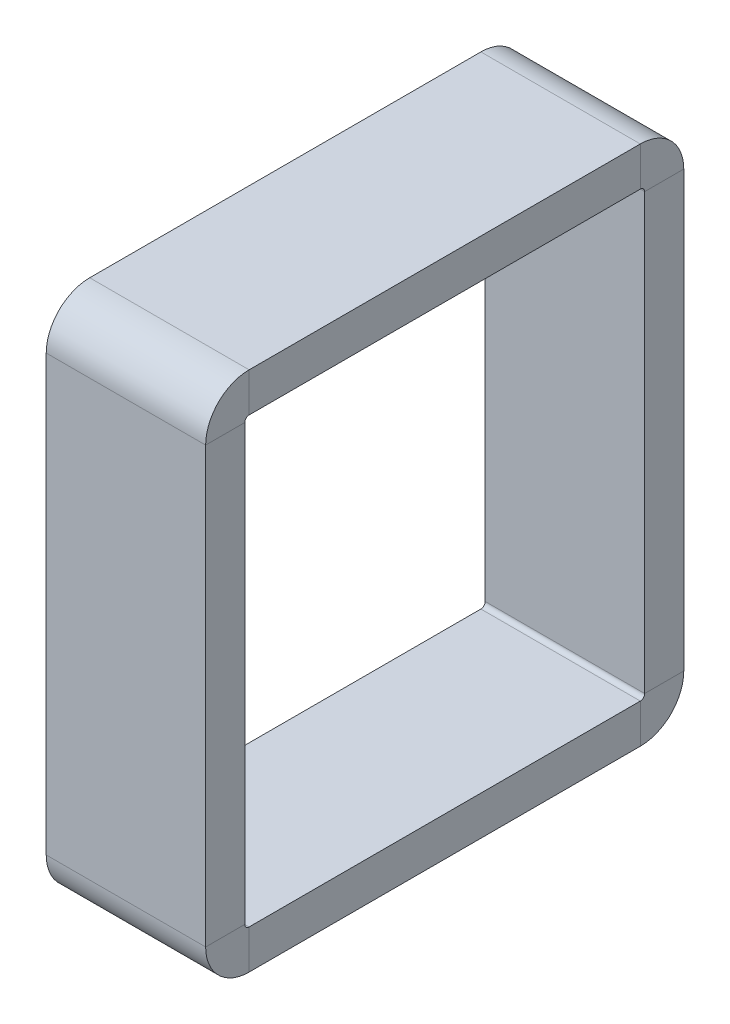
ISO-10303-21;
HEADER;
FILE_DESCRIPTION(('STEP AP214'),'2;1');
FILE_NAME('part.step','',(''),(''),'','','');
FILE_SCHEMA(('AUTOMOTIVE_DESIGN { 1 0 10303 214 1 1 1 1 }'));
ENDSEC;
DATA;
#1=APPLICATION_CONTEXT('core data for automotive mechanical design processes');
#2=APPLICATION_PROTOCOL_DEFINITION('international standard','automotive_design',2000,#1);
#3=PRODUCT_CONTEXT('',#1,'mechanical');
#4=PRODUCT('Part','Part','',(#3));
#5=PRODUCT_RELATED_PRODUCT_CATEGORY('part','',(#4));
#6=PRODUCT_DEFINITION_FORMATION('','',#4);
#7=PRODUCT_DEFINITION_CONTEXT('part definition',#1,'design');
#8=PRODUCT_DEFINITION('design','',#6,#7);
#9=PRODUCT_DEFINITION_SHAPE('','',#8);
#10=(LENGTH_UNIT() NAMED_UNIT(*) SI_UNIT(.MILLI.,.METRE.));
#11=(NAMED_UNIT(*) PLANE_ANGLE_UNIT() SI_UNIT($,.RADIAN.));
#12=(NAMED_UNIT(*) SI_UNIT($,.STERADIAN.) SOLID_ANGLE_UNIT());
#13=UNCERTAINTY_MEASURE_WITH_UNIT(LENGTH_MEASURE(1.E-05),#10,'distance_accuracy_value','');
#14=(GEOMETRIC_REPRESENTATION_CONTEXT(3) GLOBAL_UNCERTAINTY_ASSIGNED_CONTEXT((#13)) GLOBAL_UNIT_ASSIGNED_CONTEXT((#10,
#11,#12)) REPRESENTATION_CONTEXT('',''));
#15=CARTESIAN_POINT('',(0.,0.,0.));
#16=DIRECTION('',(0.,0.,1.));
#17=DIRECTION('',(1.,0.,0.));
#18=AXIS2_PLACEMENT_3D('',#15,#16,#17);
#19=CARTESIAN_POINT('',(3.716777825355,0.754999781003945,-3.2461214549909));
#20=DIRECTION('',(-1.,0.,0.));
#21=DIRECTION('',(0.,8.74227765734758E-08,-1.));
#22=AXIS2_PLACEMENT_3D('',#19,#20,#21);
#23=PLANE('',#22);
#24=CARTESIAN_POINT('',(3.716777825355,0.749999781441055,-3.25112145542801));
#25=DIRECTION('',(1.,0.,0.));
#26=DIRECTION('',(0.,-0.999999999999996,-8.74265104755868E-08));
#27=AXIS2_PLACEMENT_3D('',#24,#25,#26);
#28=CIRCLE('',#27,0.00999999999999601);
#29=CARTESIAN_POINT('',(3.716777825355,0.739999781441059,-3.25112145630224));
#30=VERTEX_POINT('',#29);
#31=CARTESIAN_POINT('',(3.716777825355,0.749999782316286,-3.26112145542801));
#32=VERTEX_POINT('',#31);
#33=EDGE_CURVE('E11',#30,#32,#28,.T.);
#34=ORIENTED_EDGE('',*,*,#33,.F.);
#35=DIRECTION('',(0.,0.999999999999996,8.74227702585115E-08));
#36=VECTOR('',#35,1.);
#37=CARTESIAN_POINT('',(3.716777825355,0.649999781442059,-3.25112146417129));
#38=LINE('',#37,#36);
#39=CARTESIAN_POINT('',(3.716777825355,0.649999781442059,-3.25112146417029));
#40=VERTEX_POINT('',#39);
#41=EDGE_CURVE('E295',#40,#30,#38,.T.);
#42=ORIENTED_EDGE('',*,*,#41,.F.);
#43=CARTESIAN_POINT('',(3.716777825355,0.749999781441727,-3.25112145542834));
#44=DIRECTION('',(-1.,0.,0.));
#45=DIRECTION('',(0.,8.74165517753117E-08,-0.999999999999996));
#46=AXIS2_PLACEMENT_3D('',#43,#44,#45);
#47=CIRCLE('',#46,0.0999999999996679);
#48=CARTESIAN_POINT('',(3.716777825355,0.749999790184336,-3.35112145542801));
#49=VERTEX_POINT('',#48);
#50=EDGE_CURVE('E292',#49,#40,#47,.T.);
#51=ORIENTED_EDGE('',*,*,#50,.F.);
#52=DIRECTION('',(0.,8.74227727247025E-08,-0.999999999999996));
#53=VECTOR('',#52,1.);
#54=CARTESIAN_POINT('',(3.716777825355,0.749999782315287,-3.26112145542801));
#55=LINE('',#54,#53);
#56=EDGE_CURVE('E281',#32,#49,#55,.T.);
#57=ORIENTED_EDGE('',*,*,#56,.F.);
#58=EDGE_LOOP('',(#34,#42,#51,#57));
#59=FACE_BOUND('',#58,.T.);
#60=ADVANCED_FACE('F17',(#59),#23,.F.);
#61=CARTESIAN_POINT('',(3.35,0.754999781003945,-3.2461214549909));
#62=DIRECTION('',(-1.,0.,0.));
#63=DIRECTION('',(0.,8.74227765734758E-08,-1.));
#64=AXIS2_PLACEMENT_3D('',#61,#62,#63);
#65=PLANE('',#64);
#66=DIRECTION('',(0.,8.74227764254459E-08,-0.999999999999996));
#67=VECTOR('',#66,1.);
#68=CARTESIAN_POINT('',(3.35,0.749999782315286,-3.26112145542801));
#69=LINE('',#68,#67);
#70=CARTESIAN_POINT('',(3.35,0.749999782316286,-3.26112145542801));
#71=VERTEX_POINT('',#70);
#72=CARTESIAN_POINT('',(3.35,0.749999790184336,-3.35112145542801));
#73=VERTEX_POINT('',#72);
#74=EDGE_CURVE('E24',#71,#73,#69,.T.);
#75=ORIENTED_EDGE('',*,*,#74,.T.);
#76=CARTESIAN_POINT('',(3.35,0.749999781441722,-3.25112145542835));
#77=DIRECTION('',(-1.,0.,0.));
#78=DIRECTION('',(0.,8.74161432132383E-08,-0.999999999999996));
#79=AXIS2_PLACEMENT_3D('',#76,#77,#78);
#80=CIRCLE('',#79,0.0999999999996679);
#81=CARTESIAN_POINT('',(3.35,0.649999781441059,-3.25112146417029));
#82=VERTEX_POINT('',#81);
#83=EDGE_CURVE('E290',#73,#82,#80,.T.);
#84=ORIENTED_EDGE('',*,*,#83,.T.);
#85=DIRECTION('',(0.,-0.999999999999996,-8.74227702585115E-08));
#86=VECTOR('',#85,1.);
#87=CARTESIAN_POINT('',(3.35,0.739999781441059,-3.25112145630324));
#88=LINE('',#87,#86);
#89=CARTESIAN_POINT('',(3.35,0.739999781441059,-3.25112145630224));
#90=VERTEX_POINT('',#89);
#91=EDGE_CURVE('E284',#90,#82,#88,.T.);
#92=ORIENTED_EDGE('',*,*,#91,.F.);
#93=CARTESIAN_POINT('',(3.35,0.74999978144101,-3.25112145542806));
#94=DIRECTION('',(1.,0.,0.));
#95=DIRECTION('',(0.,-0.999999999999996,-8.74178951449157E-08));
#96=AXIS2_PLACEMENT_3D('',#93,#94,#95);
#97=CIRCLE('',#96,0.00999999999999601);
#98=EDGE_CURVE('E274',#90,#71,#97,.T.);
#99=ORIENTED_EDGE('',*,*,#98,.T.);
#100=EDGE_LOOP('',(#75,#84,#92,#99));
#101=FACE_BOUND('',#100,.T.);
#102=ADVANCED_FACE('F409',(#101),#65,.T.);
#103=CARTESIAN_POINT('',(3.716777825355,0.749999781441727,-3.25112145542834));
#104=DIRECTION('',(-1.,0.,0.));
#105=DIRECTION('',(0.,-1.,-8.74227765734759E-08));
#106=AXIS2_PLACEMENT_3D('',#103,#104,#105);
#107=CYLINDRICAL_SURFACE('',#106,0.0999999999996679);
#108=ORIENTED_EDGE('',*,*,#50,.T.);
#109=DIRECTION('',(1.,0.,0.));
#110=VECTOR('',#109,1.);
#111=CARTESIAN_POINT('',(3.35,0.649999781442059,-3.25112146417129));
#112=LINE('',#111,#110);
#113=EDGE_CURVE('E287',#82,#40,#112,.T.);
#114=ORIENTED_EDGE('',*,*,#113,.F.);
#115=ORIENTED_EDGE('',*,*,#83,.F.);
#116=DIRECTION('',(-1.,0.,0.));
#117=VECTOR('',#116,1.);
#118=CARTESIAN_POINT('',(3.716777825355,0.749999790183336,-3.35112145542801));
#119=LINE('',#118,#117);
#120=EDGE_CURVE('E268',#49,#73,#119,.T.);
#121=ORIENTED_EDGE('',*,*,#120,.F.);
#122=EDGE_LOOP('',(#108,#114,#115,#121));
#123=FACE_BOUND('',#122,.T.);
#124=ADVANCED_FACE('F345',(#123),#107,.T.);
#125=CARTESIAN_POINT('',(3.716777825355,0.749999781441055,-3.25112145542801));
#126=DIRECTION('',(1.,1.22913533173695E-13,1.22913554664579E-13));
#127=DIRECTION('',(1.22913543919138E-13,-1.,-8.74227765734759E-08));
#128=AXIS2_PLACEMENT_3D('',#125,#126,#127);
#129=CYLINDRICAL_SURFACE('',#128,0.00999999999999601);
#130=ORIENTED_EDGE('',*,*,#33,.T.);
#131=DIRECTION('',(-1.,-1.36334428017066E-12,0.));
#132=VECTOR('',#131,1.);
#133=CARTESIAN_POINT('',(3.716777825355,0.749999782315536,-3.26112145542801));
#134=LINE('',#133,#132);
#135=EDGE_CURVE('E276',#32,#71,#134,.T.);
#136=ORIENTED_EDGE('',*,*,#135,.T.);
#137=ORIENTED_EDGE('',*,*,#98,.F.);
#138=DIRECTION('',(-1.,0.,0.));
#139=VECTOR('',#138,1.);
#140=CARTESIAN_POINT('',(3.716777825355,0.739999781441059,-3.25112145630324));
#141=LINE('',#140,#139);
#142=EDGE_CURVE('E262',#30,#90,#141,.T.);
#143=ORIENTED_EDGE('',*,*,#142,.F.);
#144=EDGE_LOOP('',(#130,#136,#137,#143));
#145=FACE_BOUND('',#144,.T.);
#146=ADVANCED_FACE('F304',(#145),#129,.F.);
#147=CARTESIAN_POINT('',(3.716777825355,0.64999970276156,-2.35112146417129));
#148=DIRECTION('',(-1.,0.,0.));
#149=DIRECTION('',(0.,1.,8.74227765734759E-08));
#150=AXIS2_PLACEMENT_3D('',#147,#148,#149);
#151=PLANE('',#150);
#152=DIRECTION('',(0.,8.7422776548804E-08,-0.999999999999996));
#153=VECTOR('',#152,1.);
#154=CARTESIAN_POINT('',(3.716777825355,0.64999970276156,-2.35112146417129));
#155=LINE('',#154,#153);
#156=CARTESIAN_POINT('',(3.716777825354,0.64999970276456,-2.35112146416829));
#157=VERTEX_POINT('',#156);
#158=EDGE_CURVE('E278',#157,#40,#155,.T.);
#159=ORIENTED_EDGE('',*,*,#158,.T.);
#160=ORIENTED_EDGE('',*,*,#41,.T.);
#161=DIRECTION('',(0.,8.74227765488039E-08,-0.999999999999996));
#162=VECTOR('',#161,1.);
#163=CARTESIAN_POINT('',(3.716777825355,0.73999970276056,-2.35112145630324));
#164=LINE('',#163,#162);
#165=CARTESIAN_POINT('',(3.716777825354,0.73999970276356,-2.35112145630024));
#166=VERTEX_POINT('',#165);
#167=EDGE_CURVE('E265',#166,#30,#164,.T.);
#168=ORIENTED_EDGE('',*,*,#167,.F.);
#169=DIRECTION('',(0.,0.999999999999996,8.74333839915547E-08));
#170=VECTOR('',#169,1.);
#171=CARTESIAN_POINT('',(3.716777825354,0.649999702762515,-2.35112146417224));
#172=LINE('',#171,#170);
#173=EDGE_CURVE('E147',#157,#166,#172,.T.);
#174=ORIENTED_EDGE('',*,*,#173,.F.);
#175=EDGE_LOOP('',(#159,#160,#168,#174));
#176=FACE_BOUND('',#175,.T.);
#177=ADVANCED_FACE('F297',(#176),#151,.F.);
#178=CARTESIAN_POINT('',(3.35,0.64999970276156,-2.35112146417129));
#179=DIRECTION('',(0.,1.,8.74227765734759E-08));
#180=DIRECTION('',(1.,0.,0.));
#181=AXIS2_PLACEMENT_3D('',#178,#179,#180);
#182=PLANE('',#181);
#183=DIRECTION('',(0.,8.7422776548804E-08,-0.999999999999996));
#184=VECTOR('',#183,1.);
#185=CARTESIAN_POINT('',(3.35,0.64999970276156,-2.35112146417129));
#186=LINE('',#185,#184);
#187=CARTESIAN_POINT('',(3.350000000001,0.64999970276456,-2.35112146416829));
#188=VERTEX_POINT('',#187);
#189=EDGE_CURVE('E271',#188,#82,#186,.T.);
#190=ORIENTED_EDGE('',*,*,#189,.T.);
#191=ORIENTED_EDGE('',*,*,#113,.T.);
#192=ORIENTED_EDGE('',*,*,#158,.F.);
#193=DIRECTION('',(1.,0.,0.));
#194=VECTOR('',#193,1.);
#195=CARTESIAN_POINT('',(3.35,0.64999970276156,-2.35112146417129));
#196=LINE('',#195,#194);
#197=EDGE_CURVE('E255',#188,#157,#196,.T.);
#198=ORIENTED_EDGE('',*,*,#197,.F.);
#199=EDGE_LOOP('',(#190,#191,#192,#198));
#200=FACE_BOUND('',#199,.T.);
#201=ADVANCED_FACE('F342',(#200),#182,.F.);
#202=CARTESIAN_POINT('',(3.716777825355,0.73999970276056,-2.35112145630324));
#203=DIRECTION('',(0.,-1.,-8.74227765734759E-08));
#204=DIRECTION('',(-1.,0.,0.));
#205=AXIS2_PLACEMENT_3D('',#202,#203,#204);
#206=PLANE('',#205);
#207=ORIENTED_EDGE('',*,*,#167,.T.);
#208=ORIENTED_EDGE('',*,*,#142,.T.);
#209=DIRECTION('',(0.,8.74227765488039E-08,-0.999999999999996));
#210=VECTOR('',#209,1.);
#211=CARTESIAN_POINT('',(3.35,0.73999970276056,-2.35112145630324));
#212=LINE('',#211,#210);
#213=CARTESIAN_POINT('',(3.350000000001,0.73999970276356,-2.35112145630024));
#214=VERTEX_POINT('',#213);
#215=EDGE_CURVE('E259',#214,#90,#212,.T.);
#216=ORIENTED_EDGE('',*,*,#215,.F.);
#217=DIRECTION('',(-1.,0.,0.));
#218=VECTOR('',#217,1.);
#219=CARTESIAN_POINT('',(3.716777825355,0.73999970276056,-2.35112145630324));
#220=LINE('',#219,#218);
#221=EDGE_CURVE('E251',#166,#214,#220,.T.);
#222=ORIENTED_EDGE('',*,*,#221,.F.);
#223=EDGE_LOOP('',(#207,#208,#216,#222));
#224=FACE_BOUND('',#223,.T.);
#225=ADVANCED_FACE('F301',(#224),#206,.F.);
#226=CARTESIAN_POINT('',(3.35,0.73999970276056,-2.35112145630324));
#227=DIRECTION('',(1.,0.,0.));
#228=DIRECTION('',(0.,-1.,-8.74227765734759E-08));
#229=AXIS2_PLACEMENT_3D('',#226,#227,#228);
#230=PLANE('',#229);
#231=ORIENTED_EDGE('',*,*,#215,.T.);
#232=ORIENTED_EDGE('',*,*,#91,.T.);
#233=ORIENTED_EDGE('',*,*,#189,.F.);
#234=DIRECTION('',(0.,-0.999999999999996,-8.74223508406647E-08));
#235=VECTOR('',#234,1.);
#236=CARTESIAN_POINT('',(3.350000000001,0.739999702760827,-2.35112145630328));
#237=LINE('',#236,#235);
#238=EDGE_CURVE('E242',#214,#188,#237,.T.);
#239=ORIENTED_EDGE('',*,*,#238,.F.);
#240=EDGE_LOOP('',(#231,#232,#233,#239));
#241=FACE_BOUND('',#240,.T.);
#242=ADVANCED_FACE('F308',(#241),#230,.F.);
#243=CARTESIAN_POINT('',(3.716777825355,1.79999979455448,-3.4011213636351));
#244=DIRECTION('',(1.,0.,0.));
#245=DIRECTION('',(0.,-8.74227765734759E-08,1.));
#246=AXIS2_PLACEMENT_3D('',#243,#244,#245);
#247=PLANE('',#246);
#248=ORIENTED_EDGE('',*,*,#56,.T.);
#249=DIRECTION('',(0.,0.999999999999996,8.74207763956744E-08));
#250=VECTOR('',#249,1.);
#251=CARTESIAN_POINT('',(3.716777825355,0.749999790183337,-3.35112145542801));
#252=LINE('',#251,#250);
#253=CARTESIAN_POINT('',(3.716777825355,1.74999979018234,-3.35112136800623));
#254=VERTEX_POINT('',#253);
#255=EDGE_CURVE('E253',#49,#254,#252,.T.);
#256=ORIENTED_EDGE('',*,*,#255,.T.);
#257=DIRECTION('',(0.,-8.74116680263222E-08,0.999999999999996));
#258=VECTOR('',#257,1.);
#259=CARTESIAN_POINT('',(3.716777825355,1.74999979018334,-3.35112136800723));
#260=LINE('',#259,#258);
#261=CARTESIAN_POINT('',(3.716777825354,1.74999978231529,-3.26112136800623));
#262=VERTEX_POINT('',#261);
#263=EDGE_CURVE('E245',#254,#262,#260,.T.);
#264=ORIENTED_EDGE('',*,*,#263,.T.);
#265=DIRECTION('',(0.,-0.999999999999996,-8.74217769285768E-08));
#266=VECTOR('',#265,1.);
#267=CARTESIAN_POINT('',(3.716777825355,1.74999978231629,-3.26112136800623));
#268=LINE('',#267,#266);
#269=EDGE_CURVE('E233',#262,#32,#268,.T.);
#270=ORIENTED_EDGE('',*,*,#269,.T.);
#271=EDGE_LOOP('',(#248,#256,#264,#270));
#272=FACE_BOUND('',#271,.T.);
#273=ADVANCED_FACE('F350',(#272),#247,.T.);
#274=CARTESIAN_POINT('',(3.716777825355,0.749999790183336,-3.35112145542801));
#275=DIRECTION('',(0.,-8.74207763956747E-08,1.));
#276=DIRECTION('',(0.,1.,8.74207763956747E-08));
#277=AXIS2_PLACEMENT_3D('',#274,#275,#276);
#278=PLANE('',#277);
#279=ORIENTED_EDGE('',*,*,#120,.T.);
#280=DIRECTION('',(0.,0.999999999999996,8.74207763956744E-08));
#281=VECTOR('',#280,1.);
#282=CARTESIAN_POINT('',(3.35,0.749999790183336,-3.35112145542801));
#283=LINE('',#282,#281);
#284=CARTESIAN_POINT('',(3.350000000001,1.74999979018234,-3.35112136800623));
#285=VERTEX_POINT('',#284);
#286=EDGE_CURVE('E247',#73,#285,#283,.T.);
#287=ORIENTED_EDGE('',*,*,#286,.T.);
#288=DIRECTION('',(-1.,0.,0.));
#289=VECTOR('',#288,1.);
#290=CARTESIAN_POINT('',(3.716777825355,1.74999979018334,-3.35112136800723));
#291=LINE('',#290,#289);
#292=EDGE_CURVE('E236',#254,#285,#291,.T.);
#293=ORIENTED_EDGE('',*,*,#292,.F.);
#294=ORIENTED_EDGE('',*,*,#255,.F.);
#295=EDGE_LOOP('',(#279,#287,#293,#294));
#296=FACE_BOUND('',#295,.T.);
#297=ADVANCED_FACE('F364',(#296),#278,.F.);
#298=CARTESIAN_POINT('',(3.716777825355,1.74999978231629,-3.26112136800623));
#299=DIRECTION('',(0.,8.74217769286645E-08,-1.));
#300=DIRECTION('',(0.,-1.,-8.74217769286645E-08));
#301=AXIS2_PLACEMENT_3D('',#298,#299,#300);
#302=PLANE('',#301);
#303=DIRECTION('',(-1.,-1.36334428017066E-12,0.));
#304=VECTOR('',#303,1.);
#305=CARTESIAN_POINT('',(3.716777825355,1.74999978231604,-3.26112136800623));
#306=LINE('',#305,#304);
#307=CARTESIAN_POINT('',(3.350000000001,1.74999978231429,-3.26112136800623));
#308=VERTEX_POINT('',#307);
#309=EDGE_CURVE('E249',#262,#308,#306,.T.);
#310=ORIENTED_EDGE('',*,*,#309,.T.);
#311=DIRECTION('',(0.,-0.999999999999996,-8.74217769286204E-08));
#312=VECTOR('',#311,1.);
#313=CARTESIAN_POINT('',(3.35,1.74999978231554,-3.26112136800623));
#314=LINE('',#313,#312);
#315=EDGE_CURVE('E239',#308,#71,#314,.T.);
#316=ORIENTED_EDGE('',*,*,#315,.T.);
#317=ORIENTED_EDGE('',*,*,#135,.F.);
#318=ORIENTED_EDGE('',*,*,#269,.F.);
#319=EDGE_LOOP('',(#310,#316,#317,#318));
#320=FACE_BOUND('',#319,.T.);
#321=ADVANCED_FACE('F355',(#320),#302,.F.);
#322=CARTESIAN_POINT('',(3.35,1.79999979455448,-3.4011213636351));
#323=DIRECTION('',(1.,0.,0.));
#324=DIRECTION('',(0.,-8.74227765734759E-08,1.));
#325=AXIS2_PLACEMENT_3D('',#322,#323,#324);
#326=PLANE('',#325);
#327=ORIENTED_EDGE('',*,*,#315,.F.);
#328=DIRECTION('',(0.,-8.74121639268677E-08,0.999999999999996));
#329=VECTOR('',#328,1.);
#330=CARTESIAN_POINT('',(3.35,1.74999979018238,-3.35112136800628));
#331=LINE('',#330,#329);
#332=EDGE_CURVE('E228',#285,#308,#331,.T.);
#333=ORIENTED_EDGE('',*,*,#332,.F.);
#334=ORIENTED_EDGE('',*,*,#286,.F.);
#335=ORIENTED_EDGE('',*,*,#74,.F.);
#336=EDGE_LOOP('',(#327,#333,#334,#335));
#337=FACE_BOUND('',#336,.T.);
#338=ADVANCED_FACE('F361',(#337),#326,.F.);
#339=CARTESIAN_POINT('',(3.716777825355,1.85499978100294,-3.24612135882784));
#340=DIRECTION('',(-1.,0.,0.));
#341=DIRECTION('',(0.,8.74227765734759E-08,-1.));
#342=AXIS2_PLACEMENT_3D('',#339,#340,#341);
#343=PLANE('',#342);
#344=CARTESIAN_POINT('',(3.716777825355,1.74999978144106,-3.25112136800624));
#345=DIRECTION('',(1.,0.,0.));
#346=DIRECTION('',(0.,8.74206040890783E-08,-0.999999999999996));
#347=AXIS2_PLACEMENT_3D('',#344,#345,#346);
#348=CIRCLE('',#347,0.00999999999999801);
#349=CARTESIAN_POINT('',(3.716777825354,1.75999978144106,-3.25112136713201));
#350=VERTEX_POINT('',#349);
#351=EDGE_CURVE('E231',#262,#350,#348,.T.);
#352=ORIENTED_EDGE('',*,*,#351,.F.);
#353=ORIENTED_EDGE('',*,*,#263,.F.);
#354=CARTESIAN_POINT('',(3.716777825355,1.74999978144126,-3.25112136800744));
#355=DIRECTION('',(-1.,0.,0.));
#356=DIRECTION('',(0.,0.999999999999996,8.74250316595352E-08));
#357=AXIS2_PLACEMENT_3D('',#354,#355,#356);
#358=CIRCLE('',#357,0.0999999999987971);
#359=CARTESIAN_POINT('',(3.716777825354,1.84999978144006,-3.25112135926396));
#360=VERTEX_POINT('',#359);
#361=EDGE_CURVE('E225',#360,#254,#358,.T.);
#362=ORIENTED_EDGE('',*,*,#361,.F.);
#363=DIRECTION('',(0.,0.999999999999996,8.74116680282651E-08));
#364=VECTOR('',#363,1.);
#365=CARTESIAN_POINT('',(3.716777825355,1.75999978144106,-3.25112136713201));
#366=LINE('',#365,#364);
#367=EDGE_CURVE('E215',#350,#360,#366,.T.);
#368=ORIENTED_EDGE('',*,*,#367,.F.);
#369=EDGE_LOOP('',(#352,#353,#362,#368));
#370=FACE_BOUND('',#369,.T.);
#371=ADVANCED_FACE('F372',(#370),#343,.F.);
#372=CARTESIAN_POINT('',(3.716777825355,1.74999978144126,-3.25112136800744));
#373=DIRECTION('',(-1.,0.,0.));
#374=DIRECTION('',(0.,-1.,-8.74227765734759E-08));
#375=AXIS2_PLACEMENT_3D('',#372,#373,#374);
#376=CYLINDRICAL_SURFACE('',#375,0.0999999999987971);
#377=ORIENTED_EDGE('',*,*,#361,.T.);
#378=ORIENTED_EDGE('',*,*,#292,.T.);
#379=CARTESIAN_POINT('',(3.35,1.74999978144127,-3.25112136800744));
#380=DIRECTION('',(-1.,0.,0.));
#381=DIRECTION('',(0.,0.999999999999996,8.74250760684562E-08));
#382=AXIS2_PLACEMENT_3D('',#379,#380,#381);
#383=CIRCLE('',#382,0.0999999999987971);
#384=CARTESIAN_POINT('',(3.350000000001,1.84999978144006,-3.25112135926396));
#385=VERTEX_POINT('',#384);
#386=EDGE_CURVE('E218',#385,#285,#383,.T.);
#387=ORIENTED_EDGE('',*,*,#386,.F.);
#388=DIRECTION('',(-1.,0.,0.));
#389=VECTOR('',#388,1.);
#390=CARTESIAN_POINT('',(3.716777825355,1.84999978144006,-3.25112135926496));
#391=LINE('',#390,#389);
#392=EDGE_CURVE('E209',#360,#385,#391,.T.);
#393=ORIENTED_EDGE('',*,*,#392,.F.);
#394=EDGE_LOOP('',(#377,#378,#387,#393));
#395=FACE_BOUND('',#394,.T.);
#396=ADVANCED_FACE('F368',(#395),#376,.T.);
#397=CARTESIAN_POINT('',(3.716777825355,1.74999978144106,-3.25112136800624));
#398=DIRECTION('',(1.,-1.22913554664586E-13,1.22913533173703E-13));
#399=DIRECTION('',(-1.22913543919143E-13,-1.,-8.74227765734759E-08));
#400=AXIS2_PLACEMENT_3D('',#397,#398,#399);
#401=CYLINDRICAL_SURFACE('',#400,0.00999999999999801);
#402=ORIENTED_EDGE('',*,*,#351,.T.);
#403=DIRECTION('',(-1.,-2.72668856034131E-12,0.));
#404=VECTOR('',#403,1.);
#405=CARTESIAN_POINT('',(3.716777825355,1.75999978144106,-3.25112136713201));
#406=LINE('',#405,#404);
#407=CARTESIAN_POINT('',(3.350000000001,1.75999978144006,-3.25112136713201));
#408=VERTEX_POINT('',#407);
#409=EDGE_CURVE('E221',#350,#408,#406,.T.);
#410=ORIENTED_EDGE('',*,*,#409,.T.);
#411=CARTESIAN_POINT('',(3.35,1.74999978144111,-3.25112136800628));
#412=DIRECTION('',(1.,0.,0.));
#413=DIRECTION('',(0.,8.73160654890796E-08,-0.999999999999996));
#414=AXIS2_PLACEMENT_3D('',#411,#412,#413);
#415=CIRCLE('',#414,0.00999999999999801);
#416=EDGE_CURVE('E212',#308,#408,#415,.T.);
#417=ORIENTED_EDGE('',*,*,#416,.F.);
#418=ORIENTED_EDGE('',*,*,#309,.F.);
#419=EDGE_LOOP('',(#402,#410,#417,#418));
#420=FACE_BOUND('',#419,.T.);
#421=ADVANCED_FACE('F374',(#420),#401,.F.);
#422=CARTESIAN_POINT('',(3.35,1.85499978100294,-3.24612135882784));
#423=DIRECTION('',(-1.,0.,0.));
#424=DIRECTION('',(0.,8.74227765734759E-08,-1.));
#425=AXIS2_PLACEMENT_3D('',#422,#423,#424);
#426=PLANE('',#425);
#427=DIRECTION('',(0.,0.999999999999996,8.74106564907553E-08));
#428=VECTOR('',#427,1.);
#429=CARTESIAN_POINT('',(3.35,1.75999978144005,-3.25112136713192));
#430=LINE('',#429,#428);
#431=EDGE_CURVE('E223',#408,#385,#430,.T.);
#432=ORIENTED_EDGE('',*,*,#431,.T.);
#433=ORIENTED_EDGE('',*,*,#386,.T.);
#434=ORIENTED_EDGE('',*,*,#332,.T.);
#435=ORIENTED_EDGE('',*,*,#416,.T.);
#436=EDGE_LOOP('',(#432,#433,#434,#435));
#437=FACE_BOUND('',#436,.T.);
#438=ADVANCED_FACE('F377',(#437),#426,.T.);
#439=CARTESIAN_POINT('',(3.716777825355,1.89499978537708,-3.29612135533093));
#440=DIRECTION('',(1.,0.,0.));
#441=DIRECTION('',(0.,-8.74227765734759E-08,1.));
#442=AXIS2_PLACEMENT_3D('',#439,#440,#441);
#443=PLANE('',#442);
#444=ORIENTED_EDGE('',*,*,#367,.T.);
#445=DIRECTION('',(0.,-8.74194432892096E-08,0.999999999999996));
#446=VECTOR('',#445,1.);
#447=CARTESIAN_POINT('',(3.716777825355,1.84999978144006,-3.25112135926496));
#448=LINE('',#447,#446);
#449=CARTESIAN_POINT('',(3.716777825354,1.84999970276256,-2.35112135926596));
#450=VERTEX_POINT('',#449);
#451=EDGE_CURVE('E207',#360,#450,#448,.T.);
#452=ORIENTED_EDGE('',*,*,#451,.T.);
#453=DIRECTION('',(0.,-0.999999999999996,-8.74227850605137E-08));
#454=VECTOR('',#453,1.);
#455=CARTESIAN_POINT('',(3.716777825355,1.84999970276256,-2.35112135926496));
#456=LINE('',#455,#454);
#457=CARTESIAN_POINT('',(3.716777825354,1.75999970276256,-2.35112136713301));
#458=VERTEX_POINT('',#457);
#459=EDGE_CURVE('E201',#450,#458,#456,.T.);
#460=ORIENTED_EDGE('',*,*,#459,.T.);
#461=DIRECTION('',(0.,8.74205547459126E-08,-0.999999999999996));
#462=VECTOR('',#461,1.);
#463=CARTESIAN_POINT('',(3.716777825355,1.75999970276256,-2.35112136713301));
#464=LINE('',#463,#462);
#465=EDGE_CURVE('E192',#458,#350,#464,.T.);
#466=ORIENTED_EDGE('',*,*,#465,.T.);
#467=EDGE_LOOP('',(#444,#452,#460,#466));
#468=FACE_BOUND('',#467,.T.);
#469=ADVANCED_FACE('F397',(#468),#443,.T.);
#470=CARTESIAN_POINT('',(3.716777825355,1.84999978144006,-3.25112135926496));
#471=DIRECTION('',(0.,-1.,-8.74194431905235E-08));
#472=DIRECTION('',(0.,-8.74194431905235E-08,1.));
#473=AXIS2_PLACEMENT_3D('',#470,#471,#472);
#474=PLANE('',#473);
#475=ORIENTED_EDGE('',*,*,#392,.T.);
#476=DIRECTION('',(0.,-8.74194432892097E-08,0.999999999999996));
#477=VECTOR('',#476,1.);
#478=CARTESIAN_POINT('',(3.35,1.84999978144006,-3.25112135926496));
#479=LINE('',#478,#477);
#480=CARTESIAN_POINT('',(3.350000000001,1.84999970276256,-2.35112135926596));
#481=VERTEX_POINT('',#480);
#482=EDGE_CURVE('E203',#385,#481,#479,.T.);
#483=ORIENTED_EDGE('',*,*,#482,.T.);
#484=DIRECTION('',(-1.,0.,0.));
#485=VECTOR('',#484,1.);
#486=CARTESIAN_POINT('',(3.716777825355,1.84999970276256,-2.35112135926496));
#487=LINE('',#486,#485);
#488=EDGE_CURVE('E195',#450,#481,#487,.T.);
#489=ORIENTED_EDGE('',*,*,#488,.F.);
#490=ORIENTED_EDGE('',*,*,#451,.F.);
#491=EDGE_LOOP('',(#475,#483,#489,#490));
#492=FACE_BOUND('',#491,.T.);
#493=ADVANCED_FACE('F381',(#492),#474,.F.);
#494=CARTESIAN_POINT('',(3.716777825355,1.75999970276256,-2.35112136713301));
#495=DIRECTION('',(-2.72668856034131E-12,1.,8.7420554400413E-08));
#496=DIRECTION('',(0.,8.7420554400413E-08,-1.));
#497=AXIS2_PLACEMENT_3D('',#494,#495,#496);
#498=PLANE('',#497);
#499=DIRECTION('',(-1.,-2.72668856034131E-12,0.));
#500=VECTOR('',#499,1.);
#501=CARTESIAN_POINT('',(3.716777825355,1.75999970276256,-2.35112136713301));
#502=LINE('',#501,#500);
#503=CARTESIAN_POINT('',(3.350000000001,1.75999970276256,-2.35112136713301));
#504=VERTEX_POINT('',#503);
#505=EDGE_CURVE('E205',#458,#504,#502,.T.);
#506=ORIENTED_EDGE('',*,*,#505,.T.);
#507=DIRECTION('',(0.,8.74205544991963E-08,-0.999999999999996));
#508=VECTOR('',#507,1.);
#509=CARTESIAN_POINT('',(3.35,1.75999970276156,-2.35112136713301));
#510=LINE('',#509,#508);
#511=EDGE_CURVE('E198',#504,#408,#510,.T.);
#512=ORIENTED_EDGE('',*,*,#511,.T.);
#513=ORIENTED_EDGE('',*,*,#409,.F.);
#514=ORIENTED_EDGE('',*,*,#465,.F.);
#515=EDGE_LOOP('',(#506,#512,#513,#514));
#516=FACE_BOUND('',#515,.T.);
#517=ADVANCED_FACE('F398',(#516),#498,.F.);
#518=CARTESIAN_POINT('',(3.35,1.89499978537708,-3.29612135533093));
#519=DIRECTION('',(1.,0.,0.));
#520=DIRECTION('',(0.,-8.74227765734759E-08,1.));
#521=AXIS2_PLACEMENT_3D('',#518,#519,#520);
#522=PLANE('',#521);
#523=ORIENTED_EDGE('',*,*,#511,.F.);
#524=DIRECTION('',(0.,-0.999999999999996,-8.74227751918646E-08));
#525=VECTOR('',#524,1.);
#526=CARTESIAN_POINT('',(3.350000000001,1.84999970276256,-2.35112135926496));
#527=LINE('',#526,#525);
#528=EDGE_CURVE('E187',#481,#504,#527,.T.);
#529=ORIENTED_EDGE('',*,*,#528,.F.);
#530=ORIENTED_EDGE('',*,*,#482,.F.);
#531=ORIENTED_EDGE('',*,*,#431,.F.);
#532=EDGE_LOOP('',(#523,#529,#530,#531));
#533=FACE_BOUND('',#532,.T.);
#534=ADVANCED_FACE('F385',(#533),#522,.F.);
#535=CARTESIAN_POINT('',(3.716777825354,1.85499969358317,-2.24612135882884));
#536=DIRECTION('',(-1.,0.,0.));
#537=DIRECTION('',(0.,8.74227765734759E-08,-1.));
#538=AXIS2_PLACEMENT_3D('',#535,#536,#537);
#539=PLANE('',#538);
#540=CARTESIAN_POINT('',(3.716777825354,1.74999970276256,-2.35112136800723));
#541=DIRECTION('',(1.,0.,0.));
#542=DIRECTION('',(0.,0.999999999999996,8.74226024905091E-08));
#543=AXIS2_PLACEMENT_3D('',#540,#541,#542);
#544=CIRCLE('',#543,0.00999999999999957);
#545=CARTESIAN_POINT('',(3.716777825354,1.74999970188733,-2.34112136800723));
#546=VERTEX_POINT('',#545);
#547=EDGE_CURVE('E190',#458,#546,#544,.T.);
#548=ORIENTED_EDGE('',*,*,#547,.F.);
#549=ORIENTED_EDGE('',*,*,#459,.F.);
#550=CARTESIAN_POINT('',(3.716777825354,1.74999970276258,-2.35112136800821));
#551=DIRECTION('',(-1.,0.,0.));
#552=DIRECTION('',(0.,-8.74230177139378E-08,0.999999999999996));
#553=AXIS2_PLACEMENT_3D('',#550,#551,#552);
#554=CIRCLE('',#553,0.0999999999999757);
#555=CARTESIAN_POINT('',(3.716777825354,1.74999969402028,-2.25112136800824));
#556=VERTEX_POINT('',#555);
#557=EDGE_CURVE('E184',#556,#450,#554,.T.);
#558=ORIENTED_EDGE('',*,*,#557,.F.);
#559=DIRECTION('',(0.,-8.74111622599545E-08,0.999999999999996));
#560=VECTOR('',#559,1.);
#561=CARTESIAN_POINT('',(3.716777825354,1.74999970188829,-2.34112136800728));
#562=LINE('',#561,#560);
#563=EDGE_CURVE('E176',#546,#556,#562,.T.);
#564=ORIENTED_EDGE('',*,*,#563,.F.);
#565=EDGE_LOOP('',(#548,#549,#558,#564));
#566=FACE_BOUND('',#565,.T.);
#567=ADVANCED_FACE('F395',(#566),#539,.F.);
#568=CARTESIAN_POINT('',(3.716777825354,1.74999970276258,-2.35112136800821));
#569=DIRECTION('',(-1.,0.,0.));
#570=DIRECTION('',(0.,-1.,-8.74227765734759E-08));
#571=AXIS2_PLACEMENT_3D('',#568,#569,#570);
#572=CYLINDRICAL_SURFACE('',#571,0.0999999999999757);
#573=ORIENTED_EDGE('',*,*,#557,.T.);
#574=ORIENTED_EDGE('',*,*,#488,.T.);
#575=CARTESIAN_POINT('',(3.350000000001,1.74999970276259,-2.35112136800821));
#576=DIRECTION('',(-1.,0.,0.));
#577=DIRECTION('',(0.,-8.74230621228587E-08,0.999999999999996));
#578=AXIS2_PLACEMENT_3D('',#575,#576,#577);
#579=CIRCLE('',#578,0.0999999999999757);
#580=CARTESIAN_POINT('',(3.350000000001,1.74999969402028,-2.25112136800824));
#581=VERTEX_POINT('',#580);
#582=EDGE_CURVE('E178',#581,#481,#579,.T.);
#583=ORIENTED_EDGE('',*,*,#582,.F.);
#584=DIRECTION('',(-1.,-1.36334428017809E-12,0.));
#585=VECTOR('',#584,1.);
#586=CARTESIAN_POINT('',(3.716777825354,1.74999969402103,-2.25112136800824));
#587=LINE('',#586,#585);
#588=EDGE_CURVE('E167',#556,#581,#587,.T.);
#589=ORIENTED_EDGE('',*,*,#588,.F.);
#590=EDGE_LOOP('',(#573,#574,#583,#589));
#591=FACE_BOUND('',#590,.T.);
#592=ADVANCED_FACE('F335',(#591),#572,.T.);
#593=CARTESIAN_POINT('',(3.716777825354,1.74999970276256,-2.35112136800723));
#594=DIRECTION('',(1.,-1.22913533173703E-13,-1.22913554664586E-13));
#595=DIRECTION('',(-1.22913543919146E-13,-1.,-8.74227765734759E-08));
#596=AXIS2_PLACEMENT_3D('',#593,#594,#595);
#597=CYLINDRICAL_SURFACE('',#596,0.00999999999999957);
#598=ORIENTED_EDGE('',*,*,#547,.T.);
#599=DIRECTION('',(-1.,0.,0.));
#600=VECTOR('',#599,1.);
#601=CARTESIAN_POINT('',(3.716777825354,1.74999970188833,-2.34112136800723));
#602=LINE('',#601,#600);
#603=CARTESIAN_POINT('',(3.350000000001,1.74999970188733,-2.34112136800723));
#604=VERTEX_POINT('',#603);
#605=EDGE_CURVE('E158',#546,#604,#602,.T.);
#606=ORIENTED_EDGE('',*,*,#605,.T.);
#607=CARTESIAN_POINT('',(3.350000000001,1.74999970276261,-2.35112136800719));
#608=DIRECTION('',(1.,0.,0.));
#609=DIRECTION('',(0.,0.999999999999996,8.74180727805686E-08));
#610=AXIS2_PLACEMENT_3D('',#607,#608,#609);
#611=CIRCLE('',#610,0.00999999999999957);
#612=EDGE_CURVE('E173',#504,#604,#611,.T.);
#613=ORIENTED_EDGE('',*,*,#612,.F.);
#614=ORIENTED_EDGE('',*,*,#505,.F.);
#615=EDGE_LOOP('',(#598,#606,#613,#614));
#616=FACE_BOUND('',#615,.T.);
#617=ADVANCED_FACE('F389',(#616),#597,.F.);
#618=CARTESIAN_POINT('',(3.350000000001,1.85499969358317,-2.24612135882884));
#619=DIRECTION('',(-1.,0.,0.));
#620=DIRECTION('',(0.,8.74227765734759E-08,-1.));
#621=AXIS2_PLACEMENT_3D('',#618,#619,#620);
#622=PLANE('',#621);
#623=DIRECTION('',(0.,-8.74227776599981E-08,0.999999999999996));
#624=VECTOR('',#623,1.);
#625=CARTESIAN_POINT('',(3.350000000001,1.74999970188833,-2.34112136800724));
#626=LINE('',#625,#624);
#627=EDGE_CURVE('E182',#604,#581,#626,.T.);
#628=ORIENTED_EDGE('',*,*,#627,.T.);
#629=ORIENTED_EDGE('',*,*,#582,.T.);
#630=ORIENTED_EDGE('',*,*,#528,.T.);
#631=ORIENTED_EDGE('',*,*,#612,.T.);
#632=EDGE_LOOP('',(#628,#629,#630,#631));
#633=FACE_BOUND('',#632,.T.);
#634=ADVANCED_FACE('F331',(#633),#622,.T.);
#635=CARTESIAN_POINT('',(3.716777825354,1.79999970626047,-2.3911213636361));
#636=DIRECTION('',(1.,0.,0.));
#637=DIRECTION('',(0.,-8.74227765734759E-08,1.));
#638=AXIS2_PLACEMENT_3D('',#635,#636,#637);
#639=PLANE('',#638);
#640=ORIENTED_EDGE('',*,*,#563,.T.);
#641=DIRECTION('',(0.,-0.999999999999996,-8.74187473519942E-08));
#642=VECTOR('',#641,1.);
#643=CARTESIAN_POINT('',(3.716777825354,1.7499996940212,-2.25112136800826));
#644=LINE('',#643,#642);
#645=CARTESIAN_POINT('',(3.716777825354,0.749999694021282,-2.25112145542701));
#646=VERTEX_POINT('',#645);
#647=EDGE_CURVE('E135',#556,#646,#644,.T.);
#648=ORIENTED_EDGE('',*,*,#647,.T.);
#649=DIRECTION('',(0.,8.74231428002584E-08,-0.999999999999996));
#650=VECTOR('',#649,1.);
#651=CARTESIAN_POINT('',(3.716777825354,0.749999694020249,-2.25112145542726));
#652=LINE('',#651,#650);
#653=CARTESIAN_POINT('',(3.716777825354,0.749999701889332,-2.34112145542601));
#654=VERTEX_POINT('',#653);
#655=EDGE_CURVE('E127',#646,#654,#652,.T.);
#656=ORIENTED_EDGE('',*,*,#655,.T.);
#657=DIRECTION('',(0.,0.999999999999996,8.74188672561608E-08));
#658=VECTOR('',#657,1.);
#659=CARTESIAN_POINT('',(3.716777825354,0.749999701888328,-2.3411214554261));
#660=LINE('',#659,#658);
#661=EDGE_CURVE('E132',#654,#546,#660,.T.);
#662=ORIENTED_EDGE('',*,*,#661,.T.);
#663=EDGE_LOOP('',(#640,#648,#656,#662));
#664=FACE_BOUND('',#663,.T.);
#665=ADVANCED_FACE('F130',(#664),#639,.T.);
#666=CARTESIAN_POINT('',(3.716777825354,1.74999969402128,-2.25112136800824));
#667=DIRECTION('',(0.,8.74187762178735E-08,-1.));
#668=DIRECTION('',(0.,-1.,-8.74187762178735E-08));
#669=AXIS2_PLACEMENT_3D('',#666,#667,#668);
#670=PLANE('',#669);
#671=ORIENTED_EDGE('',*,*,#588,.T.);
#672=DIRECTION('',(0.,-0.999999999999996,-8.74187762178295E-08));
#673=VECTOR('',#672,1.);
#674=CARTESIAN_POINT('',(3.350000000001,1.74999969402053,-2.25112136800824));
#675=LINE('',#674,#673);
#676=CARTESIAN_POINT('',(3.350000000001,0.749999694021282,-2.25112145542701));
#677=VERTEX_POINT('',#676);
#678=EDGE_CURVE('E139',#581,#677,#675,.T.);
#679=ORIENTED_EDGE('',*,*,#678,.T.);
#680=DIRECTION('',(-1.,-1.36334428017809E-12,0.));
#681=VECTOR('',#680,1.);
#682=CARTESIAN_POINT('',(3.716777825354,0.749999694020532,-2.25112145542701));
#683=LINE('',#682,#681);
#684=EDGE_CURVE('E159',#646,#677,#683,.T.);
#685=ORIENTED_EDGE('',*,*,#684,.F.);
#686=ORIENTED_EDGE('',*,*,#647,.F.);
#687=EDGE_LOOP('',(#671,#679,#685,#686));
#688=FACE_BOUND('',#687,.T.);
#689=ADVANCED_FACE('F338',(#688),#670,.F.);
#690=CARTESIAN_POINT('',(3.716777825354,0.749999701888332,-2.34112145542601));
#691=DIRECTION('',(0.,-8.74187766619627E-08,1.));
#692=DIRECTION('',(0.,1.,8.74187766619627E-08));
#693=AXIS2_PLACEMENT_3D('',#690,#691,#692);
#694=PLANE('',#693);
#695=DIRECTION('',(-1.,0.,0.));
#696=VECTOR('',#695,1.);
#697=CARTESIAN_POINT('',(3.716777825354,0.749999701888332,-2.34112145542601));
#698=LINE('',#697,#696);
#699=CARTESIAN_POINT('',(3.350000000001,0.749999701889332,-2.34112145542601));
#700=VERTEX_POINT('',#699);
#701=EDGE_CURVE('E156',#654,#700,#698,.T.);
#702=ORIENTED_EDGE('',*,*,#701,.T.);
#703=DIRECTION('',(0.,0.999999999999996,8.74187766619624E-08));
#704=VECTOR('',#703,1.);
#705=CARTESIAN_POINT('',(3.350000000001,0.749999701888332,-2.34112145542601));
#706=LINE('',#705,#704);
#707=EDGE_CURVE('E140',#700,#604,#706,.T.);
#708=ORIENTED_EDGE('',*,*,#707,.T.);
#709=ORIENTED_EDGE('',*,*,#605,.F.);
#710=ORIENTED_EDGE('',*,*,#661,.F.);
#711=EDGE_LOOP('',(#702,#708,#709,#710));
#712=FACE_BOUND('',#711,.T.);
#713=ADVANCED_FACE('F154',(#712),#694,.F.);
#714=CARTESIAN_POINT('',(3.350000000001,1.79999970625947,-2.3911213636361));
#715=DIRECTION('',(1.,0.,0.));
#716=DIRECTION('',(0.,-8.74227765734759E-08,1.));
#717=AXIS2_PLACEMENT_3D('',#714,#715,#716);
#718=PLANE('',#717);
#719=ORIENTED_EDGE('',*,*,#707,.F.);
#720=DIRECTION('',(0.,8.74222718917757E-08,-0.999999999999996));
#721=VECTOR('',#720,1.);
#722=CARTESIAN_POINT('',(3.350000000001,0.749999694020328,-2.25112145542706));
#723=LINE('',#722,#721);
#724=EDGE_CURVE('E151',#677,#700,#723,.T.);
#725=ORIENTED_EDGE('',*,*,#724,.F.);
#726=ORIENTED_EDGE('',*,*,#678,.F.);
#727=ORIENTED_EDGE('',*,*,#627,.F.);
#728=EDGE_LOOP('',(#719,#725,#726,#727));
#729=FACE_BOUND('',#728,.T.);
#730=ADVANCED_FACE('F328',(#729),#718,.F.);
#731=CARTESIAN_POINT('',(3.716777825354,0.754999693584168,-2.2461214549889));
#732=DIRECTION('',(-1.,0.,0.));
#733=DIRECTION('',(0.,8.74227765734759E-08,-1.));
#734=AXIS2_PLACEMENT_3D('',#731,#732,#733);
#735=PLANE('',#734);
#736=CARTESIAN_POINT('',(3.716777825354,0.749999702763558,-2.35112145542601));
#737=DIRECTION('',(1.,0.,0.));
#738=DIRECTION('',(0.,-8.74180727805783E-08,0.999999999999996));
#739=AXIS2_PLACEMENT_3D('',#736,#737,#738);
#740=CIRCLE('',#739,0.00999999999999845);
#741=EDGE_CURVE('E144',#654,#166,#740,.T.);
#742=ORIENTED_EDGE('',*,*,#741,.F.);
#743=ORIENTED_EDGE('',*,*,#655,.F.);
#744=CARTESIAN_POINT('',(3.716777825354,0.749999702762664,-2.35112145542511));
#745=DIRECTION('',(-1.,0.,0.));
#746=DIRECTION('',(0.,-0.999999999999996,-8.74365158071081E-08));
#747=AXIS2_PLACEMENT_3D('',#744,#745,#746);
#748=CIRCLE('',#747,0.0999999999981039);
#749=EDGE_CURVE('E317',#157,#646,#748,.T.);
#750=ORIENTED_EDGE('',*,*,#749,.F.);
#751=ORIENTED_EDGE('',*,*,#173,.T.);
#752=EDGE_LOOP('',(#742,#743,#750,#751));
#753=FACE_BOUND('',#752,.T.);
#754=ADVANCED_FACE('F145',(#753),#735,.F.);
#755=CARTESIAN_POINT('',(3.716777825354,0.749999702762664,-2.35112145542511));
#756=DIRECTION('',(-1.,0.,0.));
#757=DIRECTION('',(0.,-1.,-8.74227765734759E-08));
#758=AXIS2_PLACEMENT_3D('',#755,#756,#757);
#759=CYLINDRICAL_SURFACE('',#758,0.0999999999981039);
#760=ORIENTED_EDGE('',*,*,#749,.T.);
#761=ORIENTED_EDGE('',*,*,#684,.T.);
#762=CARTESIAN_POINT('',(3.350000000001,0.749999702762659,-2.35112145542511));
#763=DIRECTION('',(-1.,0.,0.));
#764=DIRECTION('',(0.,-0.999999999999996,-8.7436560216029E-08));
#765=AXIS2_PLACEMENT_3D('',#762,#763,#764);
#766=CIRCLE('',#765,0.0999999999981039);
#767=EDGE_CURVE('E315',#188,#677,#766,.T.);
#768=ORIENTED_EDGE('',*,*,#767,.F.);
#769=ORIENTED_EDGE('',*,*,#197,.T.);
#770=EDGE_LOOP('',(#760,#761,#768,#769));
#771=FACE_BOUND('',#770,.T.);
#772=ADVANCED_FACE('F340',(#771),#759,.T.);
#773=CARTESIAN_POINT('',(3.716777825354,0.749999702763558,-2.35112145542601));
#774=DIRECTION('',(1.,1.22913554664602E-13,-1.22913533173718E-13));
#775=DIRECTION('',(1.22913543919158E-13,-1.,-8.74227765734759E-08));
#776=AXIS2_PLACEMENT_3D('',#773,#774,#775);
#777=CYLINDRICAL_SURFACE('',#776,0.00999999999999845);
#778=ORIENTED_EDGE('',*,*,#741,.T.);
#779=ORIENTED_EDGE('',*,*,#221,.T.);
#780=CARTESIAN_POINT('',(3.350000000001,0.749999702763513,-2.35112145542596));
#781=DIRECTION('',(1.,0.,0.));
#782=DIRECTION('',(0.,-8.74135652750983E-08,0.999999999999996));
#783=AXIS2_PLACEMENT_3D('',#780,#781,#782);
#784=CIRCLE('',#783,0.00999999999999845);
#785=EDGE_CURVE('E164',#700,#214,#784,.T.);
#786=ORIENTED_EDGE('',*,*,#785,.F.);
#787=ORIENTED_EDGE('',*,*,#701,.F.);
#788=EDGE_LOOP('',(#778,#779,#786,#787));
#789=FACE_BOUND('',#788,.T.);
#790=ADVANCED_FACE('F162',(#789),#777,.F.);
#791=CARTESIAN_POINT('',(3.350000000001,0.754999693584168,-2.2461214549889));
#792=DIRECTION('',(-1.,0.,0.));
#793=DIRECTION('',(0.,8.74227765734759E-08,-1.));
#794=AXIS2_PLACEMENT_3D('',#791,#792,#793);
#795=PLANE('',#794);
#796=ORIENTED_EDGE('',*,*,#238,.T.);
#797=ORIENTED_EDGE('',*,*,#767,.T.);
#798=ORIENTED_EDGE('',*,*,#724,.T.);
#799=ORIENTED_EDGE('',*,*,#785,.T.);
#800=EDGE_LOOP('',(#796,#797,#798,#799));
#801=FACE_BOUND('',#800,.T.);
#802=ADVANCED_FACE('F313',(#801),#795,.T.);
#803=CLOSED_SHELL('',(#60,#102,#124,#146,#177,#201,#225,#242,#273,#297,#321,#338,#371,#396,#421,
#438,#469,#493,#517,#534,#567,#592,#617,#634,#665,#689,#713,#730,#754,#772,#790,#802));
#804=MANIFOLD_SOLID_BREP('B1',#803);
#805=ADVANCED_BREP_SHAPE_REPRESENTATION('',(#18,#804),#14);
#806=SHAPE_DEFINITION_REPRESENTATION(#9,#805);
ENDSEC;
END-ISO-10303-21;
